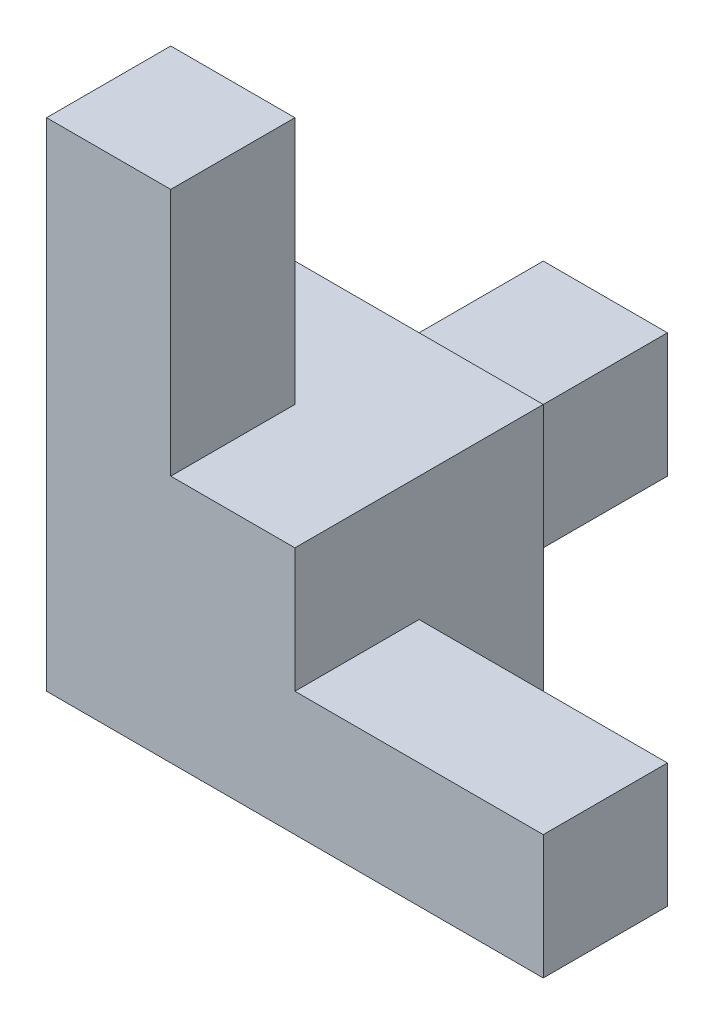
ISO-10303-21;
HEADER;
FILE_DESCRIPTION(('STEP AP214'),'2;1');
FILE_NAME('part.step','',(''),(''),'','','');
FILE_SCHEMA(('AUTOMOTIVE_DESIGN { 1 0 10303 214 1 1 1 1 }'));
ENDSEC;
DATA;
#1=APPLICATION_CONTEXT('core data for automotive mechanical design processes');
#2=APPLICATION_PROTOCOL_DEFINITION('international standard','automotive_design',2000,#1);
#3=PRODUCT_CONTEXT('',#1,'mechanical');
#4=PRODUCT('Part','Part','',(#3));
#5=PRODUCT_RELATED_PRODUCT_CATEGORY('part','',(#4));
#6=PRODUCT_DEFINITION_FORMATION('','',#4);
#7=PRODUCT_DEFINITION_CONTEXT('part definition',#1,'design');
#8=PRODUCT_DEFINITION('design','',#6,#7);
#9=PRODUCT_DEFINITION_SHAPE('','',#8);
#10=(LENGTH_UNIT() NAMED_UNIT(*) SI_UNIT(.MILLI.,.METRE.));
#11=(NAMED_UNIT(*) PLANE_ANGLE_UNIT() SI_UNIT($,.RADIAN.));
#12=(NAMED_UNIT(*) SI_UNIT($,.STERADIAN.) SOLID_ANGLE_UNIT());
#13=UNCERTAINTY_MEASURE_WITH_UNIT(LENGTH_MEASURE(1.E-05),#10,'distance_accuracy_value','');
#14=(GEOMETRIC_REPRESENTATION_CONTEXT(3) GLOBAL_UNCERTAINTY_ASSIGNED_CONTEXT((#13)) GLOBAL_UNIT_ASSIGNED_CONTEXT((#10,
#11,#12)) REPRESENTATION_CONTEXT('',''));
#15=CARTESIAN_POINT('',(0.,0.,0.));
#16=DIRECTION('',(0.,0.,1.));
#17=DIRECTION('',(1.,0.,0.));
#18=AXIS2_PLACEMENT_3D('',#15,#16,#17);
#19=CARTESIAN_POINT('',(0.,0.,0.));
#20=DIRECTION('',(0.,0.,-1.));
#21=DIRECTION('',(-1.,0.,0.));
#22=AXIS2_PLACEMENT_3D('',#19,#20,#21);
#23=PLANE('',#22);
#24=DIRECTION('',(0.,-1.,0.));
#25=VECTOR('',#24,1.);
#26=CARTESIAN_POINT('',(20.,0.,0.));
#27=LINE('',#26,#25);
#28=CARTESIAN_POINT('',(20.,10.,0.));
#29=VERTEX_POINT('',#28);
#30=CARTESIAN_POINT('',(20.,0.,0.));
#31=VERTEX_POINT('',#30);
#32=EDGE_CURVE('E201',#29,#31,#27,.T.);
#33=ORIENTED_EDGE('',*,*,#32,.F.);
#34=DIRECTION('',(-1.,0.,0.));
#35=VECTOR('',#34,1.);
#36=CARTESIAN_POINT('',(10.,10.,0.));
#37=LINE('',#36,#35);
#38=CARTESIAN_POINT('',(40.,10.,0.));
#39=VERTEX_POINT('',#38);
#40=EDGE_CURVE('E133',#39,#29,#37,.T.);
#41=ORIENTED_EDGE('',*,*,#40,.F.);
#42=DIRECTION('',(0.,1.,0.));
#43=VECTOR('',#42,1.);
#44=CARTESIAN_POINT('',(40.,0.,0.));
#45=LINE('',#44,#43);
#46=CARTESIAN_POINT('',(40.,0.,0.));
#47=VERTEX_POINT('',#46);
#48=EDGE_CURVE('E108',#47,#39,#45,.T.);
#49=ORIENTED_EDGE('',*,*,#48,.F.);
#50=DIRECTION('',(1.,0.,0.));
#51=VECTOR('',#50,1.);
#52=CARTESIAN_POINT('',(10.,0.,0.));
#53=LINE('',#52,#51);
#54=EDGE_CURVE('E129',#31,#47,#53,.T.);
#55=ORIENTED_EDGE('',*,*,#54,.F.);
#56=EDGE_LOOP('',(#33,#41,#49,#55));
#57=FACE_BOUND('',#56,.T.);
#58=ADVANCED_FACE('F33',(#57),#23,.T.);
#59=CARTESIAN_POINT('',(0.,0.,10.));
#60=DIRECTION('',(1.,0.,0.));
#61=DIRECTION('',(0.,0.,-1.));
#62=AXIS2_PLACEMENT_3D('',#59,#60,#61);
#63=PLANE('',#62);
#64=DIRECTION('',(0.,1.,0.));
#65=VECTOR('',#64,1.);
#66=CARTESIAN_POINT('',(0.,0.,-30.));
#67=LINE('',#66,#65);
#68=CARTESIAN_POINT('',(0.,0.,-30.));
#69=VERTEX_POINT('',#68);
#70=CARTESIAN_POINT('',(0.,10.,-30.));
#71=VERTEX_POINT('',#70);
#72=EDGE_CURVE('E188',#69,#71,#67,.T.);
#73=ORIENTED_EDGE('',*,*,#72,.F.);
#74=DIRECTION('',(0.,0.,-1.));
#75=VECTOR('',#74,1.);
#76=CARTESIAN_POINT('',(0.,0.,10.));
#77=LINE('',#76,#75);
#78=CARTESIAN_POINT('',(0.,0.,10.));
#79=VERTEX_POINT('',#78);
#80=EDGE_CURVE('E141',#79,#69,#77,.T.);
#81=ORIENTED_EDGE('',*,*,#80,.F.);
#82=DIRECTION('',(0.,-1.,0.));
#83=VECTOR('',#82,1.);
#84=CARTESIAN_POINT('',(0.,0.,10.));
#85=LINE('',#84,#83);
#86=CARTESIAN_POINT('',(0.,40.,10.));
#87=VERTEX_POINT('',#86);
#88=EDGE_CURVE('E84',#87,#79,#85,.T.);
#89=ORIENTED_EDGE('',*,*,#88,.F.);
#90=DIRECTION('',(0.,0.,-1.));
#91=VECTOR('',#90,1.);
#92=CARTESIAN_POINT('',(0.,40.,10.));
#93=LINE('',#92,#91);
#94=CARTESIAN_POINT('',(0.,40.,0.));
#95=VERTEX_POINT('',#94);
#96=EDGE_CURVE('E125',#87,#95,#93,.T.);
#97=ORIENTED_EDGE('',*,*,#96,.T.);
#98=DIRECTION('',(0.,-1.,0.));
#99=VECTOR('',#98,1.);
#100=CARTESIAN_POINT('',(0.,0.,0.));
#101=LINE('',#100,#99);
#102=CARTESIAN_POINT('',(0.,20.,0.));
#103=VERTEX_POINT('',#102);
#104=EDGE_CURVE('E126',#95,#103,#101,.T.);
#105=ORIENTED_EDGE('',*,*,#104,.T.);
#106=DIRECTION('',(0.,0.,1.));
#107=VECTOR('',#106,1.);
#108=CARTESIAN_POINT('',(0.,20.,-10.));
#109=LINE('',#108,#107);
#110=CARTESIAN_POINT('',(0.,20.,-10.));
#111=VERTEX_POINT('',#110);
#112=EDGE_CURVE('E212',#111,#103,#109,.T.);
#113=ORIENTED_EDGE('',*,*,#112,.F.);
#114=DIRECTION('',(0.,-1.,0.));
#115=VECTOR('',#114,1.);
#116=CARTESIAN_POINT('',(0.,0.,-10.));
#117=LINE('',#116,#115);
#118=CARTESIAN_POINT('',(0.,10.,-10.));
#119=VERTEX_POINT('',#118);
#120=EDGE_CURVE('E191',#111,#119,#117,.T.);
#121=ORIENTED_EDGE('',*,*,#120,.T.);
#122=DIRECTION('',(0.,0.,1.));
#123=VECTOR('',#122,1.);
#124=CARTESIAN_POINT('',(0.,10.,-30.));
#125=LINE('',#124,#123);
#126=EDGE_CURVE('E130',#71,#119,#125,.T.);
#127=ORIENTED_EDGE('',*,*,#126,.F.);
#128=EDGE_LOOP('',(#73,#81,#89,#97,#105,#113,#121,#127));
#129=FACE_BOUND('',#128,.T.);
#130=ADVANCED_FACE('F35',(#129),#63,.F.);
#131=CARTESIAN_POINT('',(10.,0.,10.));
#132=DIRECTION('',(0.,1.,0.));
#133=DIRECTION('',(0.,0.,1.));
#134=AXIS2_PLACEMENT_3D('',#131,#132,#133);
#135=PLANE('',#134);
#136=DIRECTION('',(0.,0.,1.));
#137=VECTOR('',#136,1.);
#138=CARTESIAN_POINT('',(20.,0.,-10.));
#139=LINE('',#138,#137);
#140=CARTESIAN_POINT('',(20.,0.,-10.));
#141=VERTEX_POINT('',#140);
#142=EDGE_CURVE('E213',#141,#31,#139,.T.);
#143=ORIENTED_EDGE('',*,*,#142,.T.);
#144=ORIENTED_EDGE('',*,*,#54,.T.);
#145=DIRECTION('',(0.,0.,-1.));
#146=VECTOR('',#145,1.);
#147=CARTESIAN_POINT('',(40.,0.,10.));
#148=LINE('',#147,#146);
#149=CARTESIAN_POINT('',(40.,0.,10.));
#150=VERTEX_POINT('',#149);
#151=EDGE_CURVE('E112',#150,#47,#148,.T.);
#152=ORIENTED_EDGE('',*,*,#151,.F.);
#153=DIRECTION('',(1.,0.,0.));
#154=VECTOR('',#153,1.);
#155=CARTESIAN_POINT('',(0.,0.,10.));
#156=LINE('',#155,#154);
#157=EDGE_CURVE('E99',#79,#150,#156,.T.);
#158=ORIENTED_EDGE('',*,*,#157,.F.);
#159=ORIENTED_EDGE('',*,*,#80,.T.);
#160=DIRECTION('',(-1.,0.,0.));
#161=VECTOR('',#160,1.);
#162=CARTESIAN_POINT('',(0.,0.,-30.));
#163=LINE('',#162,#161);
#164=CARTESIAN_POINT('',(10.,0.,-30.));
#165=VERTEX_POINT('',#164);
#166=EDGE_CURVE('E163',#165,#69,#163,.T.);
#167=ORIENTED_EDGE('',*,*,#166,.F.);
#168=DIRECTION('',(0.,0.,1.));
#169=VECTOR('',#168,1.);
#170=CARTESIAN_POINT('',(10.,0.,-30.));
#171=LINE('',#170,#169);
#172=CARTESIAN_POINT('',(10.,0.,-10.));
#173=VERTEX_POINT('',#172);
#174=EDGE_CURVE('E150',#165,#173,#171,.T.);
#175=ORIENTED_EDGE('',*,*,#174,.T.);
#176=DIRECTION('',(1.,0.,0.));
#177=VECTOR('',#176,1.);
#178=CARTESIAN_POINT('',(0.,0.,-10.));
#179=LINE('',#178,#177);
#180=EDGE_CURVE('E48',#173,#141,#179,.T.);
#181=ORIENTED_EDGE('',*,*,#180,.T.);
#182=EDGE_LOOP('',(#143,#144,#152,#158,#159,#167,#175,#181));
#183=FACE_BOUND('',#182,.T.);
#184=ADVANCED_FACE('F159',(#183),#135,.F.);
#185=CARTESIAN_POINT('',(40.,0.,10.));
#186=DIRECTION('',(-1.,0.,0.));
#187=DIRECTION('',(0.,0.,1.));
#188=AXIS2_PLACEMENT_3D('',#185,#186,#187);
#189=PLANE('',#188);
#190=ORIENTED_EDGE('',*,*,#48,.T.);
#191=DIRECTION('',(0.,0.,-1.));
#192=VECTOR('',#191,1.);
#193=CARTESIAN_POINT('',(40.,10.,10.));
#194=LINE('',#193,#192);
#195=CARTESIAN_POINT('',(40.,10.,10.));
#196=VERTEX_POINT('',#195);
#197=EDGE_CURVE('E105',#196,#39,#194,.T.);
#198=ORIENTED_EDGE('',*,*,#197,.F.);
#199=DIRECTION('',(0.,1.,0.));
#200=VECTOR('',#199,1.);
#201=CARTESIAN_POINT('',(40.,0.,10.));
#202=LINE('',#201,#200);
#203=EDGE_CURVE('E92',#150,#196,#202,.T.);
#204=ORIENTED_EDGE('',*,*,#203,.F.);
#205=ORIENTED_EDGE('',*,*,#151,.T.);
#206=EDGE_LOOP('',(#190,#198,#204,#205));
#207=FACE_BOUND('',#206,.T.);
#208=ADVANCED_FACE('F106',(#207),#189,.F.);
#209=CARTESIAN_POINT('',(10.,10.,10.));
#210=DIRECTION('',(0.,-1.,0.));
#211=DIRECTION('',(0.,0.,-1.));
#212=AXIS2_PLACEMENT_3D('',#209,#210,#211);
#213=PLANE('',#212);
#214=ORIENTED_EDGE('',*,*,#40,.T.);
#215=DIRECTION('',(0.,0.,1.));
#216=VECTOR('',#215,1.);
#217=CARTESIAN_POINT('',(20.,10.,10.));
#218=LINE('',#217,#216);
#219=CARTESIAN_POINT('',(20.,10.,10.));
#220=VERTEX_POINT('',#219);
#221=EDGE_CURVE('E118',#29,#220,#218,.T.);
#222=ORIENTED_EDGE('',*,*,#221,.T.);
#223=DIRECTION('',(-1.,0.,0.));
#224=VECTOR('',#223,1.);
#225=CARTESIAN_POINT('',(10.,10.,10.));
#226=LINE('',#225,#224);
#227=EDGE_CURVE('E98',#196,#220,#226,.T.);
#228=ORIENTED_EDGE('',*,*,#227,.F.);
#229=ORIENTED_EDGE('',*,*,#197,.T.);
#230=EDGE_LOOP('',(#214,#222,#228,#229));
#231=FACE_BOUND('',#230,.T.);
#232=ADVANCED_FACE('F116',(#231),#213,.F.);
#233=CARTESIAN_POINT('',(10.,10.,10.));
#234=DIRECTION('',(-1.,0.,0.));
#235=DIRECTION('',(0.,0.,1.));
#236=AXIS2_PLACEMENT_3D('',#233,#234,#235);
#237=PLANE('',#236);
#238=DIRECTION('',(0.,1.,0.));
#239=VECTOR('',#238,1.);
#240=CARTESIAN_POINT('',(10.,10.,10.));
#241=LINE('',#240,#239);
#242=CARTESIAN_POINT('',(10.,20.,10.));
#243=VERTEX_POINT('',#242);
#244=CARTESIAN_POINT('',(10.,40.,10.));
#245=VERTEX_POINT('',#244);
#246=EDGE_CURVE('E119',#243,#245,#241,.T.);
#247=ORIENTED_EDGE('',*,*,#246,.F.);
#248=DIRECTION('',(0.,0.,-1.));
#249=VECTOR('',#248,1.);
#250=CARTESIAN_POINT('',(10.,20.,10.));
#251=LINE('',#250,#249);
#252=CARTESIAN_POINT('',(10.,20.,0.));
#253=VERTEX_POINT('',#252);
#254=EDGE_CURVE('E208',#243,#253,#251,.T.);
#255=ORIENTED_EDGE('',*,*,#254,.T.);
#256=DIRECTION('',(0.,1.,0.));
#257=VECTOR('',#256,1.);
#258=CARTESIAN_POINT('',(10.,10.,0.));
#259=LINE('',#258,#257);
#260=CARTESIAN_POINT('',(10.,40.,0.));
#261=VERTEX_POINT('',#260);
#262=EDGE_CURVE('E135',#253,#261,#259,.T.);
#263=ORIENTED_EDGE('',*,*,#262,.T.);
#264=DIRECTION('',(0.,0.,-1.));
#265=VECTOR('',#264,1.);
#266=CARTESIAN_POINT('',(10.,40.,10.));
#267=LINE('',#266,#265);
#268=EDGE_CURVE('E113',#245,#261,#267,.T.);
#269=ORIENTED_EDGE('',*,*,#268,.F.);
#270=EDGE_LOOP('',(#247,#255,#263,#269));
#271=FACE_BOUND('',#270,.T.);
#272=ADVANCED_FACE('F262',(#271),#237,.F.);
#273=CARTESIAN_POINT('',(0.,40.,10.));
#274=DIRECTION('',(0.,-1.,0.));
#275=DIRECTION('',(0.,0.,-1.));
#276=AXIS2_PLACEMENT_3D('',#273,#274,#275);
#277=PLANE('',#276);
#278=DIRECTION('',(-1.,0.,0.));
#279=VECTOR('',#278,1.);
#280=CARTESIAN_POINT('',(0.,40.,0.));
#281=LINE('',#280,#279);
#282=EDGE_CURVE('E78',#261,#95,#281,.T.);
#283=ORIENTED_EDGE('',*,*,#282,.T.);
#284=ORIENTED_EDGE('',*,*,#96,.F.);
#285=DIRECTION('',(-1.,0.,0.));
#286=VECTOR('',#285,1.);
#287=CARTESIAN_POINT('',(0.,40.,10.));
#288=LINE('',#287,#286);
#289=EDGE_CURVE('E57',#245,#87,#288,.T.);
#290=ORIENTED_EDGE('',*,*,#289,.F.);
#291=ORIENTED_EDGE('',*,*,#268,.T.);
#292=EDGE_LOOP('',(#283,#284,#290,#291));
#293=FACE_BOUND('',#292,.T.);
#294=ADVANCED_FACE('F264',(#293),#277,.F.);
#295=CARTESIAN_POINT('',(0.,0.,10.));
#296=DIRECTION('',(0.,0.,-1.));
#297=DIRECTION('',(-1.,0.,0.));
#298=AXIS2_PLACEMENT_3D('',#295,#296,#297);
#299=PLANE('',#298);
#300=ORIENTED_EDGE('',*,*,#227,.T.);
#301=DIRECTION('',(0.,1.,0.));
#302=VECTOR('',#301,1.);
#303=CARTESIAN_POINT('',(20.,0.,10.));
#304=LINE('',#303,#302);
#305=CARTESIAN_POINT('',(20.,20.,10.));
#306=VERTEX_POINT('',#305);
#307=EDGE_CURVE('E224',#220,#306,#304,.T.);
#308=ORIENTED_EDGE('',*,*,#307,.T.);
#309=DIRECTION('',(-1.,0.,0.));
#310=VECTOR('',#309,1.);
#311=CARTESIAN_POINT('',(0.,20.,10.));
#312=LINE('',#311,#310);
#313=EDGE_CURVE('E221',#306,#243,#312,.T.);
#314=ORIENTED_EDGE('',*,*,#313,.T.);
#315=ORIENTED_EDGE('',*,*,#246,.T.);
#316=ORIENTED_EDGE('',*,*,#289,.T.);
#317=ORIENTED_EDGE('',*,*,#88,.T.);
#318=ORIENTED_EDGE('',*,*,#157,.T.);
#319=ORIENTED_EDGE('',*,*,#203,.T.);
#320=EDGE_LOOP('',(#300,#308,#314,#315,#316,#317,#318,#319));
#321=FACE_BOUND('',#320,.T.);
#322=ADVANCED_FACE('F94',(#321),#299,.F.);
#323=DIRECTION('',(1.,0.,0.));
#324=VECTOR('',#323,1.);
#325=CARTESIAN_POINT('',(0.,20.,0.));
#326=LINE('',#325,#324);
#327=EDGE_CURVE('E11',#103,#253,#326,.T.);
#328=ORIENTED_EDGE('',*,*,#327,.F.);
#329=ORIENTED_EDGE('',*,*,#104,.F.);
#330=ORIENTED_EDGE('',*,*,#282,.F.);
#331=ORIENTED_EDGE('',*,*,#262,.F.);
#332=EDGE_LOOP('',(#328,#329,#330,#331));
#333=FACE_BOUND('',#332,.T.);
#334=ADVANCED_FACE('F267',(#333),#23,.T.);
#335=CARTESIAN_POINT('',(0.,10.,-30.));
#336=DIRECTION('',(0.,-1.,0.));
#337=DIRECTION('',(0.,0.,-1.));
#338=AXIS2_PLACEMENT_3D('',#335,#336,#337);
#339=PLANE('',#338);
#340=ORIENTED_EDGE('',*,*,#126,.T.);
#341=DIRECTION('',(1.,0.,0.));
#342=VECTOR('',#341,1.);
#343=CARTESIAN_POINT('',(0.,10.,-10.));
#344=LINE('',#343,#342);
#345=CARTESIAN_POINT('',(10.,10.,-10.));
#346=VERTEX_POINT('',#345);
#347=EDGE_CURVE('E177',#119,#346,#344,.T.);
#348=ORIENTED_EDGE('',*,*,#347,.T.);
#349=DIRECTION('',(0.,0.,1.));
#350=VECTOR('',#349,1.);
#351=CARTESIAN_POINT('',(10.,10.,-30.));
#352=LINE('',#351,#350);
#353=CARTESIAN_POINT('',(10.,10.,-30.));
#354=VERTEX_POINT('',#353);
#355=EDGE_CURVE('E154',#354,#346,#352,.T.);
#356=ORIENTED_EDGE('',*,*,#355,.F.);
#357=DIRECTION('',(1.,0.,0.));
#358=VECTOR('',#357,1.);
#359=CARTESIAN_POINT('',(0.,10.,-30.));
#360=LINE('',#359,#358);
#361=EDGE_CURVE('E180',#71,#354,#360,.T.);
#362=ORIENTED_EDGE('',*,*,#361,.F.);
#363=EDGE_LOOP('',(#340,#348,#356,#362));
#364=FACE_BOUND('',#363,.T.);
#365=ADVANCED_FACE('F176',(#364),#339,.F.);
#366=CARTESIAN_POINT('',(10.,0.,-30.));
#367=DIRECTION('',(-1.,0.,0.));
#368=DIRECTION('',(0.,0.,1.));
#369=AXIS2_PLACEMENT_3D('',#366,#367,#368);
#370=PLANE('',#369);
#371=ORIENTED_EDGE('',*,*,#355,.T.);
#372=DIRECTION('',(0.,-1.,0.));
#373=VECTOR('',#372,1.);
#374=CARTESIAN_POINT('',(10.,0.,-10.));
#375=LINE('',#374,#373);
#376=EDGE_CURVE('E41',#346,#173,#375,.T.);
#377=ORIENTED_EDGE('',*,*,#376,.T.);
#378=ORIENTED_EDGE('',*,*,#174,.F.);
#379=DIRECTION('',(0.,-1.,0.));
#380=VECTOR('',#379,1.);
#381=CARTESIAN_POINT('',(10.,0.,-30.));
#382=LINE('',#381,#380);
#383=EDGE_CURVE('E166',#354,#165,#382,.T.);
#384=ORIENTED_EDGE('',*,*,#383,.F.);
#385=EDGE_LOOP('',(#371,#377,#378,#384));
#386=FACE_BOUND('',#385,.T.);
#387=ADVANCED_FACE('F147',(#386),#370,.F.);
#388=CARTESIAN_POINT('',(0.,0.,-30.));
#389=DIRECTION('',(0.,0.,-1.));
#390=DIRECTION('',(-1.,0.,0.));
#391=AXIS2_PLACEMENT_3D('',#388,#389,#390);
#392=PLANE('',#391);
#393=ORIENTED_EDGE('',*,*,#72,.T.);
#394=ORIENTED_EDGE('',*,*,#361,.T.);
#395=ORIENTED_EDGE('',*,*,#383,.T.);
#396=ORIENTED_EDGE('',*,*,#166,.T.);
#397=EDGE_LOOP('',(#393,#394,#395,#396));
#398=FACE_BOUND('',#397,.T.);
#399=ADVANCED_FACE('F200',(#398),#392,.T.);
#400=CARTESIAN_POINT('',(0.,20.,-10.));
#401=DIRECTION('',(0.,1.,0.));
#402=DIRECTION('',(0.,0.,1.));
#403=AXIS2_PLACEMENT_3D('',#400,#401,#402);
#404=PLANE('',#403);
#405=ORIENTED_EDGE('',*,*,#254,.F.);
#406=ORIENTED_EDGE('',*,*,#313,.F.);
#407=DIRECTION('',(0.,0.,1.));
#408=VECTOR('',#407,1.);
#409=CARTESIAN_POINT('',(20.,20.,-10.));
#410=LINE('',#409,#408);
#411=CARTESIAN_POINT('',(20.,20.,-10.));
#412=VERTEX_POINT('',#411);
#413=EDGE_CURVE('E215',#412,#306,#410,.T.);
#414=ORIENTED_EDGE('',*,*,#413,.F.);
#415=DIRECTION('',(-1.,0.,0.));
#416=VECTOR('',#415,1.);
#417=CARTESIAN_POINT('',(0.,20.,-10.));
#418=LINE('',#417,#416);
#419=EDGE_CURVE('E216',#412,#111,#418,.T.);
#420=ORIENTED_EDGE('',*,*,#419,.T.);
#421=ORIENTED_EDGE('',*,*,#112,.T.);
#422=ORIENTED_EDGE('',*,*,#327,.T.);
#423=EDGE_LOOP('',(#405,#406,#414,#420,#421,#422));
#424=FACE_BOUND('',#423,.T.);
#425=ADVANCED_FACE('F244',(#424),#404,.T.);
#426=CARTESIAN_POINT('',(0.,0.,-10.));
#427=DIRECTION('',(0.,0.,-1.));
#428=DIRECTION('',(-1.,0.,0.));
#429=AXIS2_PLACEMENT_3D('',#426,#427,#428);
#430=PLANE('',#429);
#431=ORIENTED_EDGE('',*,*,#347,.F.);
#432=ORIENTED_EDGE('',*,*,#120,.F.);
#433=ORIENTED_EDGE('',*,*,#419,.F.);
#434=DIRECTION('',(0.,1.,0.));
#435=VECTOR('',#434,1.);
#436=CARTESIAN_POINT('',(20.,0.,-10.));
#437=LINE('',#436,#435);
#438=EDGE_CURVE('E228',#141,#412,#437,.T.);
#439=ORIENTED_EDGE('',*,*,#438,.F.);
#440=ORIENTED_EDGE('',*,*,#180,.F.);
#441=ORIENTED_EDGE('',*,*,#376,.F.);
#442=EDGE_LOOP('',(#431,#432,#433,#439,#440,#441));
#443=FACE_BOUND('',#442,.T.);
#444=ADVANCED_FACE('F241',(#443),#430,.T.);
#445=CARTESIAN_POINT('',(20.,0.,-10.));
#446=DIRECTION('',(1.,0.,0.));
#447=DIRECTION('',(0.,0.,-1.));
#448=AXIS2_PLACEMENT_3D('',#445,#446,#447);
#449=PLANE('',#448);
#450=ORIENTED_EDGE('',*,*,#221,.F.);
#451=ORIENTED_EDGE('',*,*,#32,.T.);
#452=ORIENTED_EDGE('',*,*,#142,.F.);
#453=ORIENTED_EDGE('',*,*,#438,.T.);
#454=ORIENTED_EDGE('',*,*,#413,.T.);
#455=ORIENTED_EDGE('',*,*,#307,.F.);
#456=EDGE_LOOP('',(#450,#451,#452,#453,#454,#455));
#457=FACE_BOUND('',#456,.T.);
#458=ADVANCED_FACE('F235',(#457),#449,.T.);
#459=CLOSED_SHELL('',(#58,#130,#184,#208,#232,#272,#294,#322,#334,#365,#387,#399,#425,#444,#458));
#460=MANIFOLD_SOLID_BREP('B2',#459);
#461=ADVANCED_BREP_SHAPE_REPRESENTATION('',(#18,#460),#14);
#462=SHAPE_DEFINITION_REPRESENTATION(#9,#461);
ENDSEC;
END-ISO-10303-21;
